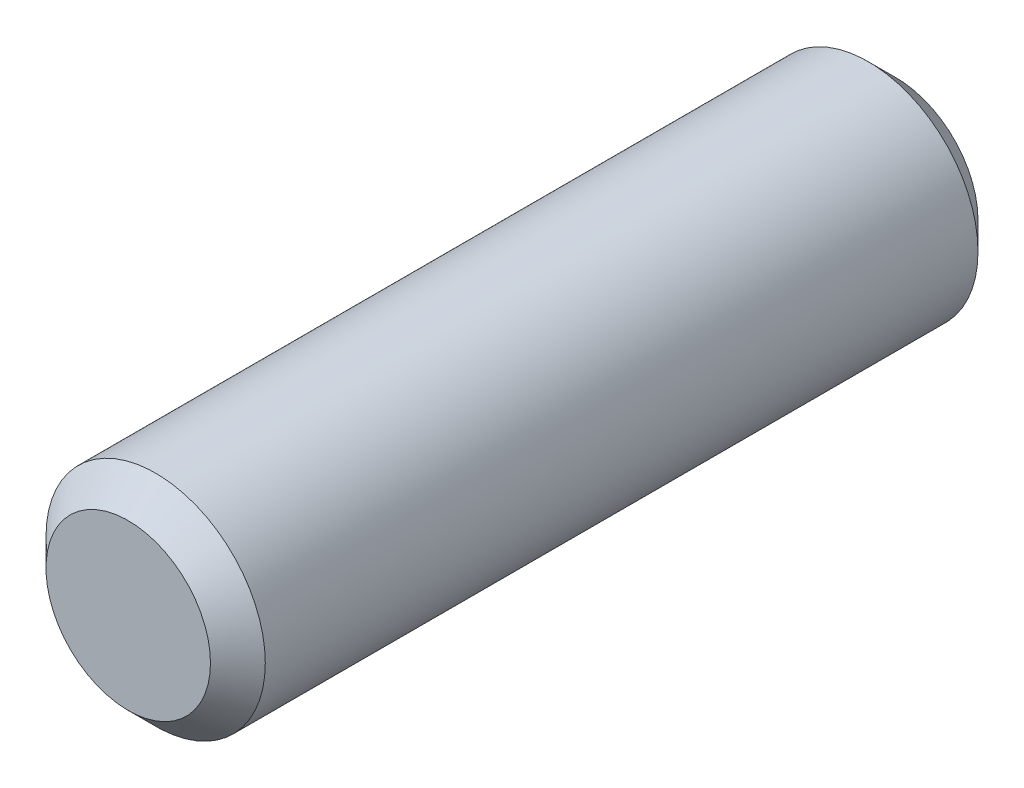
ISO-10303-21;
HEADER;
FILE_DESCRIPTION(('STEP AP214'),'2;1');
FILE_NAME('part.step','',(''),(''),'','','');
FILE_SCHEMA(('AUTOMOTIVE_DESIGN { 1 0 10303 214 1 1 1 1 }'));
ENDSEC;
DATA;
#1=APPLICATION_CONTEXT('core data for automotive mechanical design processes');
#2=APPLICATION_PROTOCOL_DEFINITION('international standard','automotive_design',2000,#1);
#3=PRODUCT_CONTEXT('',#1,'mechanical');
#4=PRODUCT('Part','Part','',(#3));
#5=PRODUCT_RELATED_PRODUCT_CATEGORY('part','',(#4));
#6=PRODUCT_DEFINITION_FORMATION('','',#4);
#7=PRODUCT_DEFINITION_CONTEXT('part definition',#1,'design');
#8=PRODUCT_DEFINITION('design','',#6,#7);
#9=PRODUCT_DEFINITION_SHAPE('','',#8);
#10=(LENGTH_UNIT() NAMED_UNIT(*) SI_UNIT(.MILLI.,.METRE.));
#11=(NAMED_UNIT(*) PLANE_ANGLE_UNIT() SI_UNIT($,.RADIAN.));
#12=(NAMED_UNIT(*) SI_UNIT($,.STERADIAN.) SOLID_ANGLE_UNIT());
#13=UNCERTAINTY_MEASURE_WITH_UNIT(LENGTH_MEASURE(1.E-05),#10,'distance_accuracy_value','');
#14=(GEOMETRIC_REPRESENTATION_CONTEXT(3) GLOBAL_UNCERTAINTY_ASSIGNED_CONTEXT((#13)) GLOBAL_UNIT_ASSIGNED_CONTEXT((#10,
#11,#12)) REPRESENTATION_CONTEXT('',''));
#15=CARTESIAN_POINT('',(0.,0.,0.));
#16=DIRECTION('',(0.,0.,1.));
#17=DIRECTION('',(1.,0.,0.));
#18=AXIS2_PLACEMENT_3D('',#15,#16,#17);
#19=CARTESIAN_POINT('',(0.,0.,14.));
#20=DIRECTION('',(0.,0.,-1.));
#21=DIRECTION('',(-1.,0.,0.));
#22=AXIS2_PLACEMENT_3D('',#19,#20,#21);
#23=CYLINDRICAL_SURFACE('',#22,2.);
#24=CARTESIAN_POINT('',(0.,0.,0.500000000000009));
#25=DIRECTION('',(0.,0.,1.));
#26=DIRECTION('',(1.,0.,0.));
#27=AXIS2_PLACEMENT_3D('',#24,#25,#26);
#28=CIRCLE('',#27,2.);
#29=CARTESIAN_POINT('',(2.,0.,0.500000000000009));
#30=VERTEX_POINT('',#29);
#31=EDGE_CURVE('E57',#30,#30,#28,.T.);
#32=ORIENTED_EDGE('',*,*,#31,.T.);
#33=EDGE_LOOP('',(#32));
#34=FACE_BOUND('',#33,.T.);
#35=CARTESIAN_POINT('',(0.,0.,13.5));
#36=DIRECTION('',(0.,0.,1.));
#37=DIRECTION('',(1.,0.,0.));
#38=AXIS2_PLACEMENT_3D('',#35,#36,#37);
#39=CIRCLE('',#38,2.);
#40=CARTESIAN_POINT('',(2.,0.,13.5));
#41=VERTEX_POINT('',#40);
#42=EDGE_CURVE('E63',#41,#41,#39,.F.);
#43=ORIENTED_EDGE('',*,*,#42,.T.);
#44=EDGE_LOOP('',(#43));
#45=FACE_BOUND('',#44,.T.);
#46=ADVANCED_FACE('F42',(#34,#45),#23,.T.);
#47=CARTESIAN_POINT('',(0.,0.,14.));
#48=DIRECTION('',(0.,0.,1.));
#49=DIRECTION('',(1.,0.,0.));
#50=AXIS2_PLACEMENT_3D('',#47,#48,#49);
#51=PLANE('',#50);
#52=CARTESIAN_POINT('',(0.,0.,14.));
#53=DIRECTION('',(0.,0.,1.));
#54=DIRECTION('',(1.,0.,0.));
#55=AXIS2_PLACEMENT_3D('',#52,#53,#54);
#56=CIRCLE('',#55,1.50000000000001);
#57=CARTESIAN_POINT('',(1.50000000000001,0.,14.));
#58=VERTEX_POINT('',#57);
#59=EDGE_CURVE('E10',#58,#58,#56,.T.);
#60=ORIENTED_EDGE('',*,*,#59,.T.);
#61=EDGE_LOOP('',(#60));
#62=FACE_BOUND('',#61,.T.);
#63=ADVANCED_FACE('F81',(#62),#51,.T.);
#64=CARTESIAN_POINT('',(0.,0.,0.));
#65=DIRECTION('',(0.,0.,1.));
#66=DIRECTION('',(1.,0.,0.));
#67=AXIS2_PLACEMENT_3D('',#64,#65,#66);
#68=PLANE('',#67);
#69=CARTESIAN_POINT('',(0.,0.,0.));
#70=DIRECTION('',(0.,0.,1.));
#71=DIRECTION('',(1.,0.,0.));
#72=AXIS2_PLACEMENT_3D('',#69,#70,#71);
#73=CIRCLE('',#72,1.49999999999999);
#74=CARTESIAN_POINT('',(1.49999999999999,0.,0.));
#75=VERTEX_POINT('',#74);
#76=EDGE_CURVE('E51',#75,#75,#73,.F.);
#77=ORIENTED_EDGE('',*,*,#76,.T.);
#78=EDGE_LOOP('',(#77));
#79=FACE_BOUND('',#78,.T.);
#80=ADVANCED_FACE('F78',(#79),#68,.F.);
#81=CARTESIAN_POINT('',(0.,0.,0.500000000000009));
#82=DIRECTION('',(0.,0.,1.));
#83=DIRECTION('',(1.,0.,0.));
#84=AXIS2_PLACEMENT_3D('',#81,#82,#83);
#85=CONICAL_SURFACE('',#84,2.,0.785398163397452);
#86=ORIENTED_EDGE('',*,*,#76,.F.);
#87=EDGE_LOOP('',(#86));
#88=FACE_BOUND('',#87,.T.);
#89=ORIENTED_EDGE('',*,*,#31,.F.);
#90=EDGE_LOOP('',(#89));
#91=FACE_BOUND('',#90,.T.);
#92=ADVANCED_FACE('F74',(#88,#91),#85,.T.);
#93=CARTESIAN_POINT('',(0.,0.,14.));
#94=DIRECTION('',(0.,0.,-1.));
#95=DIRECTION('',(-1.,0.,0.));
#96=AXIS2_PLACEMENT_3D('',#93,#94,#95);
#97=CONICAL_SURFACE('',#96,1.50000000000001,0.785398163397447);
#98=ORIENTED_EDGE('',*,*,#42,.F.);
#99=EDGE_LOOP('',(#98));
#100=FACE_BOUND('',#99,.T.);
#101=ORIENTED_EDGE('',*,*,#59,.F.);
#102=EDGE_LOOP('',(#101));
#103=FACE_BOUND('',#102,.T.);
#104=ADVANCED_FACE('F45',(#100,#103),#97,.T.);
#105=CLOSED_SHELL('',(#46,#63,#80,#92,#104));
#106=MANIFOLD_SOLID_BREP('B2',#105);
#107=ADVANCED_BREP_SHAPE_REPRESENTATION('',(#18,#106),#14);
#108=SHAPE_DEFINITION_REPRESENTATION(#9,#107);
ENDSEC;
END-ISO-10303-21;
